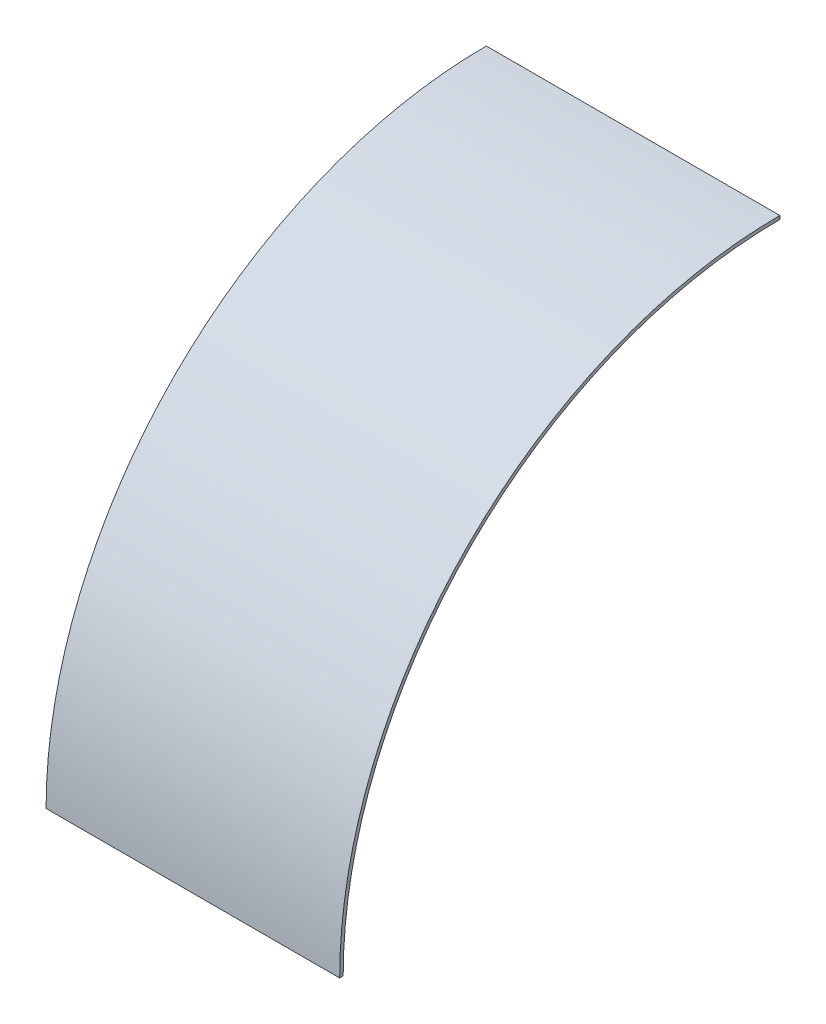
ISO-10303-21;
HEADER;
FILE_DESCRIPTION(('STEP AP214'),'2;1');
FILE_NAME('part.step','',(''),(''),'','','');
FILE_SCHEMA(('AUTOMOTIVE_DESIGN { 1 0 10303 214 1 1 1 1 }'));
ENDSEC;
DATA;
#1=APPLICATION_CONTEXT('core data for automotive mechanical design processes');
#2=APPLICATION_PROTOCOL_DEFINITION('international standard','automotive_design',2000,#1);
#3=PRODUCT_CONTEXT('',#1,'mechanical');
#4=PRODUCT('Part','Part','',(#3));
#5=PRODUCT_RELATED_PRODUCT_CATEGORY('part','',(#4));
#6=PRODUCT_DEFINITION_FORMATION('','',#4);
#7=PRODUCT_DEFINITION_CONTEXT('part definition',#1,'design');
#8=PRODUCT_DEFINITION('design','',#6,#7);
#9=PRODUCT_DEFINITION_SHAPE('','',#8);
#10=(LENGTH_UNIT() NAMED_UNIT(*) SI_UNIT(.MILLI.,.METRE.));
#11=(NAMED_UNIT(*) PLANE_ANGLE_UNIT() SI_UNIT($,.RADIAN.));
#12=(NAMED_UNIT(*) SI_UNIT($,.STERADIAN.) SOLID_ANGLE_UNIT());
#13=UNCERTAINTY_MEASURE_WITH_UNIT(LENGTH_MEASURE(1.E-05),#10,'distance_accuracy_value','');
#14=(GEOMETRIC_REPRESENTATION_CONTEXT(3) GLOBAL_UNCERTAINTY_ASSIGNED_CONTEXT((#13)) GLOBAL_UNIT_ASSIGNED_CONTEXT((#10,
#11,#12)) REPRESENTATION_CONTEXT('',''));
#15=CARTESIAN_POINT('',(0.,0.,0.));
#16=DIRECTION('',(0.,0.,1.));
#17=DIRECTION('',(1.,0.,0.));
#18=AXIS2_PLACEMENT_3D('',#15,#16,#17);
#19=CARTESIAN_POINT('',(133.35,0.,0.));
#20=DIRECTION('',(-1.,0.,0.));
#21=DIRECTION('',(0.,0.,1.));
#22=AXIS2_PLACEMENT_3D('',#19,#20,#21);
#23=CYLINDRICAL_SURFACE('',#22,199.9615);
#24=CARTESIAN_POINT('',(0.,0.,0.));
#25=DIRECTION('',(1.,0.,0.));
#26=DIRECTION('',(0.,0.,-1.));
#27=AXIS2_PLACEMENT_3D('',#24,#25,#26);
#28=CIRCLE('',#27,199.9615);
#29=CARTESIAN_POINT('',(0.,199.9615,0.));
#30=VERTEX_POINT('',#29);
#31=CARTESIAN_POINT('',(0.,0.,199.9615));
#32=VERTEX_POINT('',#31);
#33=EDGE_CURVE('E96',#30,#32,#28,.T.);
#34=ORIENTED_EDGE('',*,*,#33,.T.);
#35=DIRECTION('',(-1.,0.,0.));
#36=VECTOR('',#35,1.);
#37=CARTESIAN_POINT('',(133.35,0.,199.9615));
#38=LINE('',#37,#36);
#39=CARTESIAN_POINT('',(133.35,0.,199.9615));
#40=VERTEX_POINT('',#39);
#41=EDGE_CURVE('E11',#40,#32,#38,.T.);
#42=ORIENTED_EDGE('',*,*,#41,.F.);
#43=CARTESIAN_POINT('',(133.35,0.,0.));
#44=DIRECTION('',(1.,0.,0.));
#45=DIRECTION('',(0.,0.,-1.));
#46=AXIS2_PLACEMENT_3D('',#43,#44,#45);
#47=CIRCLE('',#46,199.9615);
#48=CARTESIAN_POINT('',(133.35,199.9615,0.));
#49=VERTEX_POINT('',#48);
#50=EDGE_CURVE('E73',#49,#40,#47,.T.);
#51=ORIENTED_EDGE('',*,*,#50,.F.);
#52=DIRECTION('',(-1.,0.,0.));
#53=VECTOR('',#52,1.);
#54=CARTESIAN_POINT('',(133.35,199.9615,0.));
#55=LINE('',#54,#53);
#56=EDGE_CURVE('E49',#49,#30,#55,.T.);
#57=ORIENTED_EDGE('',*,*,#56,.T.);
#58=EDGE_LOOP('',(#34,#42,#51,#57));
#59=FACE_BOUND('',#58,.T.);
#60=ADVANCED_FACE('F33',(#59),#23,.T.);
#61=CARTESIAN_POINT('',(133.35,0.,198.374));
#62=DIRECTION('',(0.,-1.,0.));
#63=DIRECTION('',(0.,0.,-1.));
#64=AXIS2_PLACEMENT_3D('',#61,#62,#63);
#65=PLANE('',#64);
#66=DIRECTION('',(0.,0.,1.));
#67=VECTOR('',#66,1.);
#68=CARTESIAN_POINT('',(0.,0.,198.374));
#69=LINE('',#68,#67);
#70=CARTESIAN_POINT('',(0.,0.,198.374));
#71=VERTEX_POINT('',#70);
#72=EDGE_CURVE('E82',#71,#32,#69,.T.);
#73=ORIENTED_EDGE('',*,*,#72,.F.);
#74=DIRECTION('',(-1.,0.,0.));
#75=VECTOR('',#74,1.);
#76=CARTESIAN_POINT('',(133.35,0.,198.374));
#77=LINE('',#76,#75);
#78=CARTESIAN_POINT('',(133.35,0.,198.374));
#79=VERTEX_POINT('',#78);
#80=EDGE_CURVE('E41',#79,#71,#77,.T.);
#81=ORIENTED_EDGE('',*,*,#80,.F.);
#82=DIRECTION('',(0.,0.,1.));
#83=VECTOR('',#82,1.);
#84=CARTESIAN_POINT('',(133.35,0.,198.374));
#85=LINE('',#84,#83);
#86=EDGE_CURVE('E80',#79,#40,#85,.T.);
#87=ORIENTED_EDGE('',*,*,#86,.T.);
#88=ORIENTED_EDGE('',*,*,#41,.T.);
#89=EDGE_LOOP('',(#73,#81,#87,#88));
#90=FACE_BOUND('',#89,.T.);
#91=ADVANCED_FACE('F79',(#90),#65,.T.);
#92=CARTESIAN_POINT('',(133.35,0.,0.));
#93=DIRECTION('',(-1.,0.,0.));
#94=DIRECTION('',(0.,0.,1.));
#95=AXIS2_PLACEMENT_3D('',#92,#93,#94);
#96=CYLINDRICAL_SURFACE('',#95,198.374);
#97=CARTESIAN_POINT('',(0.,0.,0.));
#98=DIRECTION('',(1.,0.,0.));
#99=DIRECTION('',(0.,0.,-1.));
#100=AXIS2_PLACEMENT_3D('',#97,#98,#99);
#101=CIRCLE('',#100,198.374);
#102=CARTESIAN_POINT('',(0.,198.374,0.));
#103=VERTEX_POINT('',#102);
#104=EDGE_CURVE('E99',#103,#71,#101,.T.);
#105=ORIENTED_EDGE('',*,*,#104,.F.);
#106=DIRECTION('',(-1.,0.,0.));
#107=VECTOR('',#106,1.);
#108=CARTESIAN_POINT('',(133.35,198.374,0.));
#109=LINE('',#108,#107);
#110=CARTESIAN_POINT('',(133.35,198.374,0.));
#111=VERTEX_POINT('',#110);
#112=EDGE_CURVE('E62',#111,#103,#109,.T.);
#113=ORIENTED_EDGE('',*,*,#112,.F.);
#114=CARTESIAN_POINT('',(133.35,0.,0.));
#115=DIRECTION('',(1.,0.,0.));
#116=DIRECTION('',(0.,0.,-1.));
#117=AXIS2_PLACEMENT_3D('',#114,#115,#116);
#118=CIRCLE('',#117,198.374);
#119=EDGE_CURVE('E88',#111,#79,#118,.T.);
#120=ORIENTED_EDGE('',*,*,#119,.T.);
#121=ORIENTED_EDGE('',*,*,#80,.T.);
#122=EDGE_LOOP('',(#105,#113,#120,#121));
#123=FACE_BOUND('',#122,.T.);
#124=ADVANCED_FACE('F90',(#123),#96,.F.);
#125=CARTESIAN_POINT('',(133.35,199.9615,0.));
#126=DIRECTION('',(0.,0.,-1.));
#127=DIRECTION('',(0.,1.,0.));
#128=AXIS2_PLACEMENT_3D('',#125,#126,#127);
#129=PLANE('',#128);
#130=DIRECTION('',(0.,-1.,0.));
#131=VECTOR('',#130,1.);
#132=CARTESIAN_POINT('',(0.,199.9615,0.));
#133=LINE('',#132,#131);
#134=EDGE_CURVE('E101',#30,#103,#133,.T.);
#135=ORIENTED_EDGE('',*,*,#134,.F.);
#136=ORIENTED_EDGE('',*,*,#56,.F.);
#137=DIRECTION('',(0.,-1.,0.));
#138=VECTOR('',#137,1.);
#139=CARTESIAN_POINT('',(133.35,199.9615,0.));
#140=LINE('',#139,#138);
#141=EDGE_CURVE('E91',#49,#111,#140,.T.);
#142=ORIENTED_EDGE('',*,*,#141,.T.);
#143=ORIENTED_EDGE('',*,*,#112,.T.);
#144=EDGE_LOOP('',(#135,#136,#142,#143));
#145=FACE_BOUND('',#144,.T.);
#146=ADVANCED_FACE('F107',(#145),#129,.T.);
#147=CARTESIAN_POINT('',(133.35,0.,0.));
#148=DIRECTION('',(1.,0.,0.));
#149=DIRECTION('',(0.,0.,-1.));
#150=AXIS2_PLACEMENT_3D('',#147,#148,#149);
#151=PLANE('',#150);
#152=ORIENTED_EDGE('',*,*,#50,.T.);
#153=ORIENTED_EDGE('',*,*,#86,.F.);
#154=ORIENTED_EDGE('',*,*,#119,.F.);
#155=ORIENTED_EDGE('',*,*,#141,.F.);
#156=EDGE_LOOP('',(#152,#153,#154,#155));
#157=FACE_BOUND('',#156,.T.);
#158=ADVANCED_FACE('F87',(#157),#151,.T.);
#159=CARTESIAN_POINT('',(0.,0.,0.));
#160=DIRECTION('',(1.,0.,0.));
#161=DIRECTION('',(0.,0.,-1.));
#162=AXIS2_PLACEMENT_3D('',#159,#160,#161);
#163=PLANE('',#162);
#164=ORIENTED_EDGE('',*,*,#33,.F.);
#165=ORIENTED_EDGE('',*,*,#134,.T.);
#166=ORIENTED_EDGE('',*,*,#104,.T.);
#167=ORIENTED_EDGE('',*,*,#72,.T.);
#168=EDGE_LOOP('',(#164,#165,#166,#167));
#169=FACE_BOUND('',#168,.T.);
#170=ADVANCED_FACE('F106',(#169),#163,.F.);
#171=CLOSED_SHELL('',(#60,#91,#124,#146,#158,#170));
#172=MANIFOLD_SOLID_BREP('B2',#171);
#173=ADVANCED_BREP_SHAPE_REPRESENTATION('',(#18,#172),#14);
#174=SHAPE_DEFINITION_REPRESENTATION(#9,#173);
ENDSEC;
END-ISO-10303-21;
